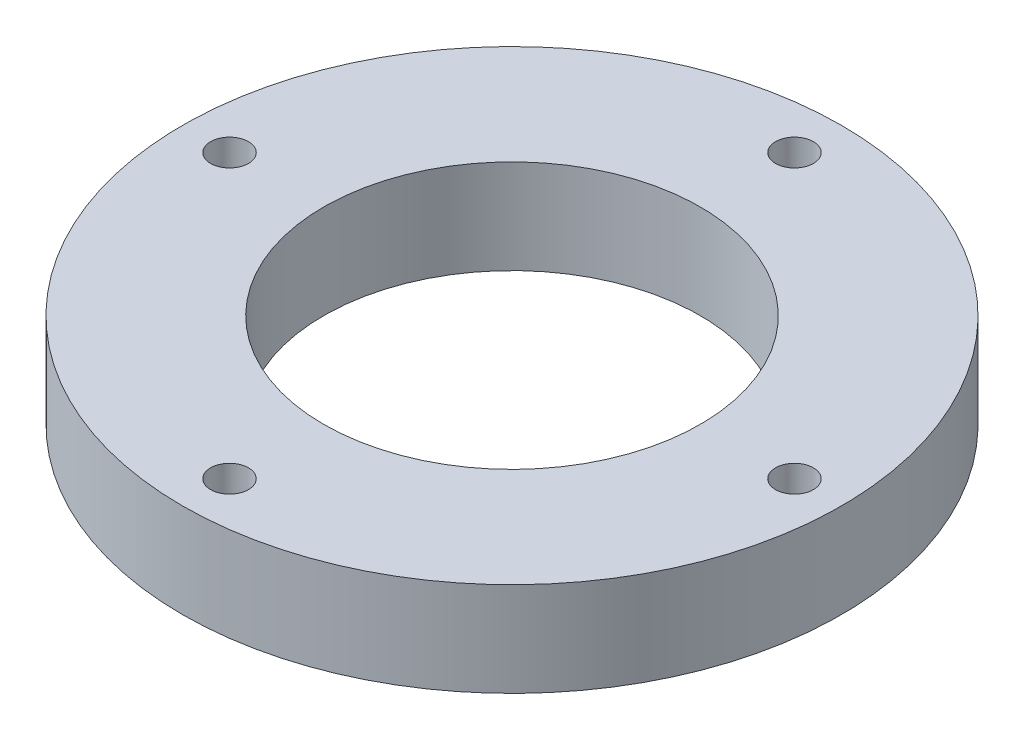
ISO-10303-21;
HEADER;
FILE_DESCRIPTION(('STEP AP214'),'2;1');
FILE_NAME('part.step','',(''),(''),'','','');
FILE_SCHEMA(('AUTOMOTIVE_DESIGN { 1 0 10303 214 1 1 1 1 }'));
ENDSEC;
DATA;
#1=APPLICATION_CONTEXT('core data for automotive mechanical design processes');
#2=APPLICATION_PROTOCOL_DEFINITION('international standard','automotive_design',2000,#1);
#3=PRODUCT_CONTEXT('',#1,'mechanical');
#4=PRODUCT('Part','Part','',(#3));
#5=PRODUCT_RELATED_PRODUCT_CATEGORY('part','',(#4));
#6=PRODUCT_DEFINITION_FORMATION('','',#4);
#7=PRODUCT_DEFINITION_CONTEXT('part definition',#1,'design');
#8=PRODUCT_DEFINITION('design','',#6,#7);
#9=PRODUCT_DEFINITION_SHAPE('','',#8);
#10=(LENGTH_UNIT() NAMED_UNIT(*) SI_UNIT(.MILLI.,.METRE.));
#11=(NAMED_UNIT(*) PLANE_ANGLE_UNIT() SI_UNIT($,.RADIAN.));
#12=(NAMED_UNIT(*) SI_UNIT($,.STERADIAN.) SOLID_ANGLE_UNIT());
#13=UNCERTAINTY_MEASURE_WITH_UNIT(LENGTH_MEASURE(1.E-05),#10,'distance_accuracy_value','');
#14=(GEOMETRIC_REPRESENTATION_CONTEXT(3) GLOBAL_UNCERTAINTY_ASSIGNED_CONTEXT((#13)) GLOBAL_UNIT_ASSIGNED_CONTEXT((#10,
#11,#12)) REPRESENTATION_CONTEXT('',''));
#15=CARTESIAN_POINT('',(0.,0.,0.));
#16=DIRECTION('',(0.,0.,1.));
#17=DIRECTION('',(1.,0.,0.));
#18=AXIS2_PLACEMENT_3D('',#15,#16,#17);
#19=CARTESIAN_POINT('',(0.,12.7,0.));
#20=DIRECTION('',(0.,-1.,0.));
#21=DIRECTION('',(0.,0.,-1.));
#22=AXIS2_PLACEMENT_3D('',#19,#20,#21);
#23=CYLINDRICAL_SURFACE('',#22,44.45);
#24=CARTESIAN_POINT('',(0.,12.7,0.));
#25=DIRECTION('',(0.,1.,0.));
#26=DIRECTION('',(0.,0.,1.));
#27=AXIS2_PLACEMENT_3D('',#24,#25,#26);
#28=CIRCLE('',#27,44.45);
#29=CARTESIAN_POINT('',(0.,12.7,44.45));
#30=VERTEX_POINT('',#29);
#31=EDGE_CURVE('E10',#30,#30,#28,.T.);
#32=ORIENTED_EDGE('',*,*,#31,.F.);
#33=EDGE_LOOP('',(#32));
#34=FACE_BOUND('',#33,.T.);
#35=CARTESIAN_POINT('',(0.,0.,0.));
#36=DIRECTION('',(0.,1.,0.));
#37=DIRECTION('',(0.,0.,1.));
#38=AXIS2_PLACEMENT_3D('',#35,#36,#37);
#39=CIRCLE('',#38,44.45);
#40=CARTESIAN_POINT('',(0.,0.,44.45));
#41=VERTEX_POINT('',#40);
#42=EDGE_CURVE('E34',#41,#41,#39,.T.);
#43=ORIENTED_EDGE('',*,*,#42,.T.);
#44=EDGE_LOOP('',(#43));
#45=FACE_BOUND('',#44,.T.);
#46=ADVANCED_FACE('F31',(#34,#45),#23,.T.);
#47=CARTESIAN_POINT('',(0.,12.7,0.));
#48=DIRECTION('',(0.,1.,0.));
#49=DIRECTION('',(0.,0.,1.));
#50=AXIS2_PLACEMENT_3D('',#47,#48,#49);
#51=PLANE('',#50);
#52=CARTESIAN_POINT('',(-38.1,12.7,-3.99076548174802E-13));
#53=DIRECTION('',(0.,1.,0.));
#54=DIRECTION('',(0.,0.,1.));
#55=AXIS2_PLACEMENT_3D('',#52,#53,#54);
#56=CIRCLE('',#55,2.55269999999998);
#57=CARTESIAN_POINT('',(-38.1,12.7,2.55269999999958));
#58=VERTEX_POINT('',#57);
#59=EDGE_CURVE('E69',#58,#58,#56,.T.);
#60=ORIENTED_EDGE('',*,*,#59,.F.);
#61=EDGE_LOOP('',(#60));
#62=FACE_BOUND('',#61,.T.);
#63=CARTESIAN_POINT('',(0.,12.7,38.1));
#64=DIRECTION('',(0.,1.,0.));
#65=DIRECTION('',(0.,0.,1.));
#66=AXIS2_PLACEMENT_3D('',#63,#64,#65);
#67=CIRCLE('',#66,2.55269999999999);
#68=CARTESIAN_POINT('',(0.,12.7,40.6527));
#69=VERTEX_POINT('',#68);
#70=EDGE_CURVE('E63',#69,#69,#67,.T.);
#71=ORIENTED_EDGE('',*,*,#70,.F.);
#72=EDGE_LOOP('',(#71));
#73=FACE_BOUND('',#72,.T.);
#74=CARTESIAN_POINT('',(38.1,12.7,1.33025516058267E-13));
#75=DIRECTION('',(0.,1.,0.));
#76=DIRECTION('',(0.,0.,1.));
#77=AXIS2_PLACEMENT_3D('',#74,#75,#76);
#78=CIRCLE('',#77,2.55269999999998);
#79=CARTESIAN_POINT('',(38.1,12.7,2.55270000000012));
#80=VERTEX_POINT('',#79);
#81=EDGE_CURVE('E57',#80,#80,#78,.T.);
#82=ORIENTED_EDGE('',*,*,#81,.F.);
#83=EDGE_LOOP('',(#82));
#84=FACE_BOUND('',#83,.T.);
#85=CARTESIAN_POINT('',(0.,12.7,-38.1));
#86=DIRECTION('',(0.,1.,0.));
#87=DIRECTION('',(0.,0.,1.));
#88=AXIS2_PLACEMENT_3D('',#85,#86,#87);
#89=CIRCLE('',#88,2.55269999999999);
#90=CARTESIAN_POINT('',(0.,12.7,-35.5473));
#91=VERTEX_POINT('',#90);
#92=EDGE_CURVE('E51',#91,#91,#89,.T.);
#93=ORIENTED_EDGE('',*,*,#92,.F.);
#94=EDGE_LOOP('',(#93));
#95=FACE_BOUND('',#94,.T.);
#96=CARTESIAN_POINT('',(0.,12.7,0.));
#97=DIRECTION('',(0.,1.,0.));
#98=DIRECTION('',(0.,0.,1.));
#99=AXIS2_PLACEMENT_3D('',#96,#97,#98);
#100=CIRCLE('',#99,25.4);
#101=CARTESIAN_POINT('',(0.,12.7,25.4));
#102=VERTEX_POINT('',#101);
#103=EDGE_CURVE('E43',#102,#102,#100,.T.);
#104=ORIENTED_EDGE('',*,*,#103,.F.);
#105=EDGE_LOOP('',(#104));
#106=FACE_BOUND('',#105,.T.);
#107=ORIENTED_EDGE('',*,*,#31,.T.);
#108=EDGE_LOOP('',(#107));
#109=FACE_BOUND('',#108,.T.);
#110=ADVANCED_FACE('F75',(#62,#73,#84,#95,#106,#109),#51,.T.);
#111=CARTESIAN_POINT('',(0.,0.,0.));
#112=DIRECTION('',(0.,1.,0.));
#113=DIRECTION('',(0.,0.,1.));
#114=AXIS2_PLACEMENT_3D('',#111,#112,#113);
#115=PLANE('',#114);
#116=CARTESIAN_POINT('',(-38.1,0.,-3.99076548174802E-13));
#117=DIRECTION('',(0.,1.,0.));
#118=DIRECTION('',(0.,0.,1.));
#119=AXIS2_PLACEMENT_3D('',#116,#117,#118);
#120=CIRCLE('',#119,2.5527);
#121=CARTESIAN_POINT('',(-38.1,0.,2.5526999999996));
#122=VERTEX_POINT('',#121);
#123=EDGE_CURVE('E66',#122,#122,#120,.T.);
#124=ORIENTED_EDGE('',*,*,#123,.T.);
#125=EDGE_LOOP('',(#124));
#126=FACE_BOUND('',#125,.T.);
#127=CARTESIAN_POINT('',(0.,0.,38.1));
#128=DIRECTION('',(0.,1.,0.));
#129=DIRECTION('',(0.,0.,1.));
#130=AXIS2_PLACEMENT_3D('',#127,#128,#129);
#131=CIRCLE('',#130,2.5527);
#132=CARTESIAN_POINT('',(0.,0.,40.6527));
#133=VERTEX_POINT('',#132);
#134=EDGE_CURVE('E60',#133,#133,#131,.T.);
#135=ORIENTED_EDGE('',*,*,#134,.T.);
#136=EDGE_LOOP('',(#135));
#137=FACE_BOUND('',#136,.T.);
#138=CARTESIAN_POINT('',(38.1,0.,1.33025516058267E-13));
#139=DIRECTION('',(0.,1.,0.));
#140=DIRECTION('',(0.,0.,1.));
#141=AXIS2_PLACEMENT_3D('',#138,#139,#140);
#142=CIRCLE('',#141,2.5527);
#143=CARTESIAN_POINT('',(38.1,0.,2.55270000000013));
#144=VERTEX_POINT('',#143);
#145=EDGE_CURVE('E54',#144,#144,#142,.T.);
#146=ORIENTED_EDGE('',*,*,#145,.T.);
#147=EDGE_LOOP('',(#146));
#148=FACE_BOUND('',#147,.T.);
#149=CARTESIAN_POINT('',(0.,0.,-38.1));
#150=DIRECTION('',(0.,1.,0.));
#151=DIRECTION('',(0.,0.,1.));
#152=AXIS2_PLACEMENT_3D('',#149,#150,#151);
#153=CIRCLE('',#152,2.5527);
#154=CARTESIAN_POINT('',(0.,0.,-35.5473));
#155=VERTEX_POINT('',#154);
#156=EDGE_CURVE('E46',#155,#155,#153,.T.);
#157=ORIENTED_EDGE('',*,*,#156,.T.);
#158=EDGE_LOOP('',(#157));
#159=FACE_BOUND('',#158,.T.);
#160=CARTESIAN_POINT('',(0.,0.,0.));
#161=DIRECTION('',(0.,1.,0.));
#162=DIRECTION('',(0.,0.,1.));
#163=AXIS2_PLACEMENT_3D('',#160,#161,#162);
#164=CIRCLE('',#163,25.4);
#165=CARTESIAN_POINT('',(0.,0.,25.4));
#166=VERTEX_POINT('',#165);
#167=EDGE_CURVE('E41',#166,#166,#164,.T.);
#168=ORIENTED_EDGE('',*,*,#167,.T.);
#169=EDGE_LOOP('',(#168));
#170=FACE_BOUND('',#169,.T.);
#171=ORIENTED_EDGE('',*,*,#42,.F.);
#172=EDGE_LOOP('',(#171));
#173=FACE_BOUND('',#172,.T.);
#174=ADVANCED_FACE('F78',(#126,#137,#148,#159,#170,#173),#115,.F.);
#175=CARTESIAN_POINT('',(0.,0.,0.));
#176=DIRECTION('',(0.,1.,0.));
#177=DIRECTION('',(0.,0.,1.));
#178=AXIS2_PLACEMENT_3D('',#175,#176,#177);
#179=CYLINDRICAL_SURFACE('',#178,25.4);
#180=ORIENTED_EDGE('',*,*,#167,.F.);
#181=EDGE_LOOP('',(#180));
#182=FACE_BOUND('',#181,.T.);
#183=ORIENTED_EDGE('',*,*,#103,.T.);
#184=EDGE_LOOP('',(#183));
#185=FACE_BOUND('',#184,.T.);
#186=ADVANCED_FACE('F88',(#182,#185),#179,.F.);
#187=CARTESIAN_POINT('',(0.,12.7,-38.1));
#188=DIRECTION('',(0.,1.,0.));
#189=DIRECTION('',(0.,0.,1.));
#190=AXIS2_PLACEMENT_3D('',#187,#188,#189);
#191=CYLINDRICAL_SURFACE('',#190,2.55269999999999);
#192=ORIENTED_EDGE('',*,*,#156,.F.);
#193=EDGE_LOOP('',(#192));
#194=FACE_BOUND('',#193,.T.);
#195=ORIENTED_EDGE('',*,*,#92,.T.);
#196=EDGE_LOOP('',(#195));
#197=FACE_BOUND('',#196,.T.);
#198=ADVANCED_FACE('F90',(#194,#197),#191,.F.);
#199=CARTESIAN_POINT('',(38.1,12.7,1.33025516058267E-13));
#200=DIRECTION('',(0.,1.,0.));
#201=DIRECTION('',(0.,0.,1.));
#202=AXIS2_PLACEMENT_3D('',#199,#200,#201);
#203=CYLINDRICAL_SURFACE('',#202,2.55269999999999);
#204=ORIENTED_EDGE('',*,*,#145,.F.);
#205=EDGE_LOOP('',(#204));
#206=FACE_BOUND('',#205,.T.);
#207=ORIENTED_EDGE('',*,*,#81,.T.);
#208=EDGE_LOOP('',(#207));
#209=FACE_BOUND('',#208,.T.);
#210=ADVANCED_FACE('F97',(#206,#209),#203,.F.);
#211=CARTESIAN_POINT('',(0.,12.7,38.1));
#212=DIRECTION('',(0.,1.,0.));
#213=DIRECTION('',(0.,0.,1.));
#214=AXIS2_PLACEMENT_3D('',#211,#212,#213);
#215=CYLINDRICAL_SURFACE('',#214,2.55269999999999);
#216=ORIENTED_EDGE('',*,*,#134,.F.);
#217=EDGE_LOOP('',(#216));
#218=FACE_BOUND('',#217,.T.);
#219=ORIENTED_EDGE('',*,*,#70,.T.);
#220=EDGE_LOOP('',(#219));
#221=FACE_BOUND('',#220,.T.);
#222=ADVANCED_FACE('F128',(#218,#221),#215,.F.);
#223=CARTESIAN_POINT('',(-38.1,12.7,-3.99076548174802E-13));
#224=DIRECTION('',(0.,1.,0.));
#225=DIRECTION('',(0.,0.,1.));
#226=AXIS2_PLACEMENT_3D('',#223,#224,#225);
#227=CYLINDRICAL_SURFACE('',#226,2.55269999999999);
#228=ORIENTED_EDGE('',*,*,#123,.F.);
#229=EDGE_LOOP('',(#228));
#230=FACE_BOUND('',#229,.T.);
#231=ORIENTED_EDGE('',*,*,#59,.T.);
#232=EDGE_LOOP('',(#231));
#233=FACE_BOUND('',#232,.T.);
#234=ADVANCED_FACE('F73',(#230,#233),#227,.F.);
#235=CLOSED_SHELL('',(#46,#110,#174,#186,#198,#210,#222,#234));
#236=MANIFOLD_SOLID_BREP('B2',#235);
#237=ADVANCED_BREP_SHAPE_REPRESENTATION('',(#18,#236),#14);
#238=SHAPE_DEFINITION_REPRESENTATION(#9,#237);
ENDSEC;
END-ISO-10303-21;
